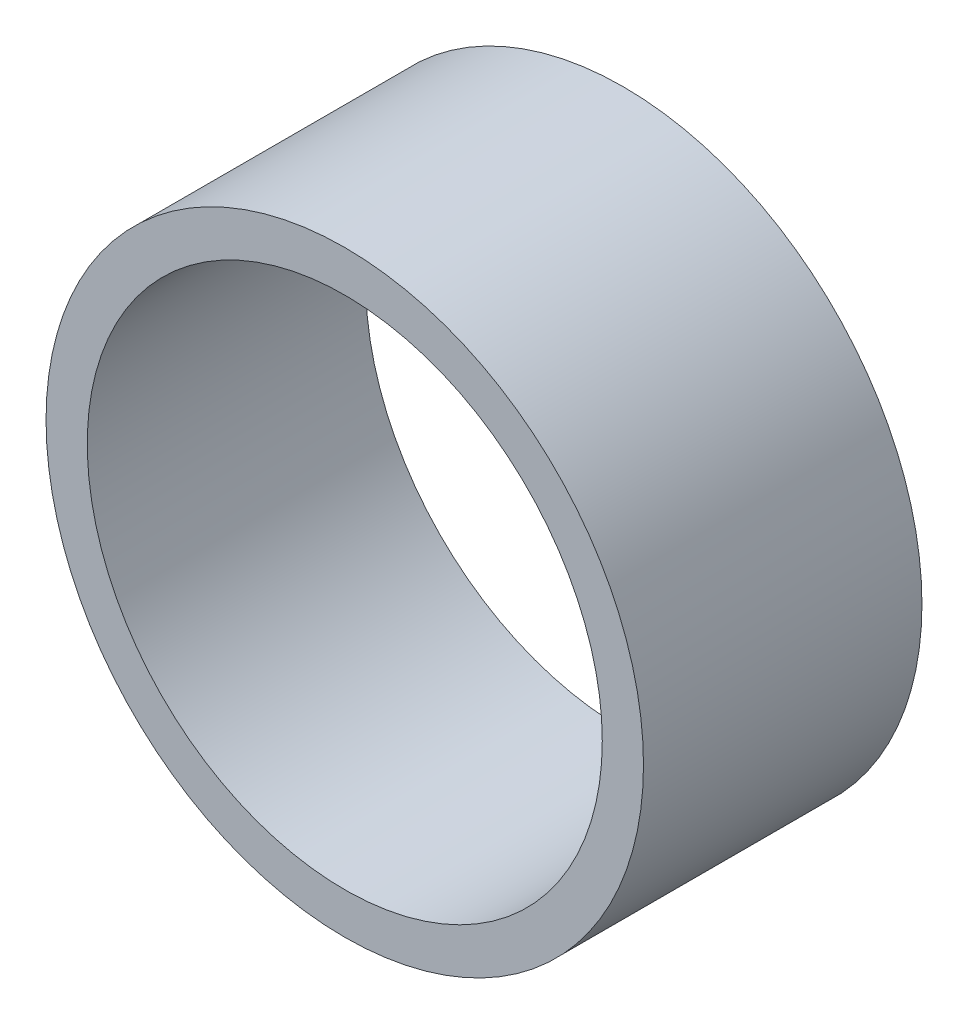
ISO-10303-21;
HEADER;
FILE_DESCRIPTION(('STEP AP214'),'2;1');
FILE_NAME('part.step','',(''),(''),'','','');
FILE_SCHEMA(('AUTOMOTIVE_DESIGN { 1 0 10303 214 1 1 1 1 }'));
ENDSEC;
DATA;
#1=APPLICATION_CONTEXT('core data for automotive mechanical design processes');
#2=APPLICATION_PROTOCOL_DEFINITION('international standard','automotive_design',2000,#1);
#3=PRODUCT_CONTEXT('',#1,'mechanical');
#4=PRODUCT('Part','Part','',(#3));
#5=PRODUCT_RELATED_PRODUCT_CATEGORY('part','',(#4));
#6=PRODUCT_DEFINITION_FORMATION('','',#4);
#7=PRODUCT_DEFINITION_CONTEXT('part definition',#1,'design');
#8=PRODUCT_DEFINITION('design','',#6,#7);
#9=PRODUCT_DEFINITION_SHAPE('','',#8);
#10=(LENGTH_UNIT() NAMED_UNIT(*) SI_UNIT(.MILLI.,.METRE.));
#11=(NAMED_UNIT(*) PLANE_ANGLE_UNIT() SI_UNIT($,.RADIAN.));
#12=(NAMED_UNIT(*) SI_UNIT($,.STERADIAN.) SOLID_ANGLE_UNIT());
#13=UNCERTAINTY_MEASURE_WITH_UNIT(LENGTH_MEASURE(1.E-05),#10,'distance_accuracy_value','');
#14=(GEOMETRIC_REPRESENTATION_CONTEXT(3) GLOBAL_UNCERTAINTY_ASSIGNED_CONTEXT((#13)) GLOBAL_UNIT_ASSIGNED_CONTEXT((#10,
#11,#12)) REPRESENTATION_CONTEXT('',''));
#15=CARTESIAN_POINT('',(0.,0.,0.));
#16=DIRECTION('',(0.,0.,1.));
#17=DIRECTION('',(1.,0.,0.));
#18=AXIS2_PLACEMENT_3D('',#15,#16,#17);
#19=CARTESIAN_POINT('',(0.,0.,81.1));
#20=DIRECTION('',(0.,0.,1.));
#21=DIRECTION('',(1.,0.,0.));
#22=AXIS2_PLACEMENT_3D('',#19,#20,#21);
#23=PLANE('',#22);
#24=CARTESIAN_POINT('',(0.,0.,81.1));
#25=DIRECTION('',(0.,0.,1.));
#26=DIRECTION('',(1.,0.,0.));
#27=AXIS2_PLACEMENT_3D('',#24,#25,#26);
#28=CIRCLE('',#27,87.);
#29=CARTESIAN_POINT('',(87.,0.,81.1));
#30=VERTEX_POINT('',#29);
#31=EDGE_CURVE('E10',#30,#30,#28,.T.);
#32=ORIENTED_EDGE('',*,*,#31,.T.);
#33=EDGE_LOOP('',(#32));
#34=FACE_BOUND('',#33,.T.);
#35=CARTESIAN_POINT('',(0.,0.,81.1));
#36=DIRECTION('',(0.,0.,1.));
#37=DIRECTION('',(1.,0.,0.));
#38=AXIS2_PLACEMENT_3D('',#35,#36,#37);
#39=CIRCLE('',#38,75.);
#40=CARTESIAN_POINT('',(75.,0.,81.1));
#41=VERTEX_POINT('',#40);
#42=EDGE_CURVE('E43',#41,#41,#39,.T.);
#43=ORIENTED_EDGE('',*,*,#42,.F.);
#44=EDGE_LOOP('',(#43));
#45=FACE_BOUND('',#44,.T.);
#46=ADVANCED_FACE('F32',(#34,#45),#23,.T.);
#47=CARTESIAN_POINT('',(0.,0.,0.));
#48=DIRECTION('',(0.,0.,1.));
#49=DIRECTION('',(1.,0.,0.));
#50=AXIS2_PLACEMENT_3D('',#47,#48,#49);
#51=PLANE('',#50);
#52=CARTESIAN_POINT('',(0.,0.,0.));
#53=DIRECTION('',(0.,0.,1.));
#54=DIRECTION('',(1.,0.,0.));
#55=AXIS2_PLACEMENT_3D('',#52,#53,#54);
#56=CIRCLE('',#55,87.);
#57=CARTESIAN_POINT('',(87.,0.,0.));
#58=VERTEX_POINT('',#57);
#59=EDGE_CURVE('E36',#58,#58,#56,.T.);
#60=ORIENTED_EDGE('',*,*,#59,.F.);
#61=EDGE_LOOP('',(#60));
#62=FACE_BOUND('',#61,.T.);
#63=CARTESIAN_POINT('',(0.,0.,0.));
#64=DIRECTION('',(0.,0.,1.));
#65=DIRECTION('',(1.,0.,0.));
#66=AXIS2_PLACEMENT_3D('',#63,#64,#65);
#67=CIRCLE('',#66,75.);
#68=CARTESIAN_POINT('',(75.,0.,0.));
#69=VERTEX_POINT('',#68);
#70=EDGE_CURVE('E45',#69,#69,#67,.T.);
#71=ORIENTED_EDGE('',*,*,#70,.T.);
#72=EDGE_LOOP('',(#71));
#73=FACE_BOUND('',#72,.T.);
#74=ADVANCED_FACE('F55',(#62,#73),#51,.F.);
#75=CARTESIAN_POINT('',(0.,0.,81.1));
#76=DIRECTION('',(0.,0.,-1.));
#77=DIRECTION('',(-1.,0.,0.));
#78=AXIS2_PLACEMENT_3D('',#75,#76,#77);
#79=CYLINDRICAL_SURFACE('',#78,87.);
#80=ORIENTED_EDGE('',*,*,#31,.F.);
#81=EDGE_LOOP('',(#80));
#82=FACE_BOUND('',#81,.T.);
#83=ORIENTED_EDGE('',*,*,#59,.T.);
#84=EDGE_LOOP('',(#83));
#85=FACE_BOUND('',#84,.T.);
#86=ADVANCED_FACE('F34',(#82,#85),#79,.T.);
#87=CARTESIAN_POINT('',(0.,0.,81.1));
#88=DIRECTION('',(0.,0.,-1.));
#89=DIRECTION('',(-1.,0.,0.));
#90=AXIS2_PLACEMENT_3D('',#87,#88,#89);
#91=CYLINDRICAL_SURFACE('',#90,75.);
#92=ORIENTED_EDGE('',*,*,#42,.T.);
#93=EDGE_LOOP('',(#92));
#94=FACE_BOUND('',#93,.T.);
#95=ORIENTED_EDGE('',*,*,#70,.F.);
#96=EDGE_LOOP('',(#95));
#97=FACE_BOUND('',#96,.T.);
#98=ADVANCED_FACE('F51',(#94,#97),#91,.F.);
#99=CLOSED_SHELL('',(#46,#74,#86,#98));
#100=MANIFOLD_SOLID_BREP('B2',#99);
#101=ADVANCED_BREP_SHAPE_REPRESENTATION('',(#18,#100),#14);
#102=SHAPE_DEFINITION_REPRESENTATION(#9,#101);
ENDSEC;
END-ISO-10303-21;
